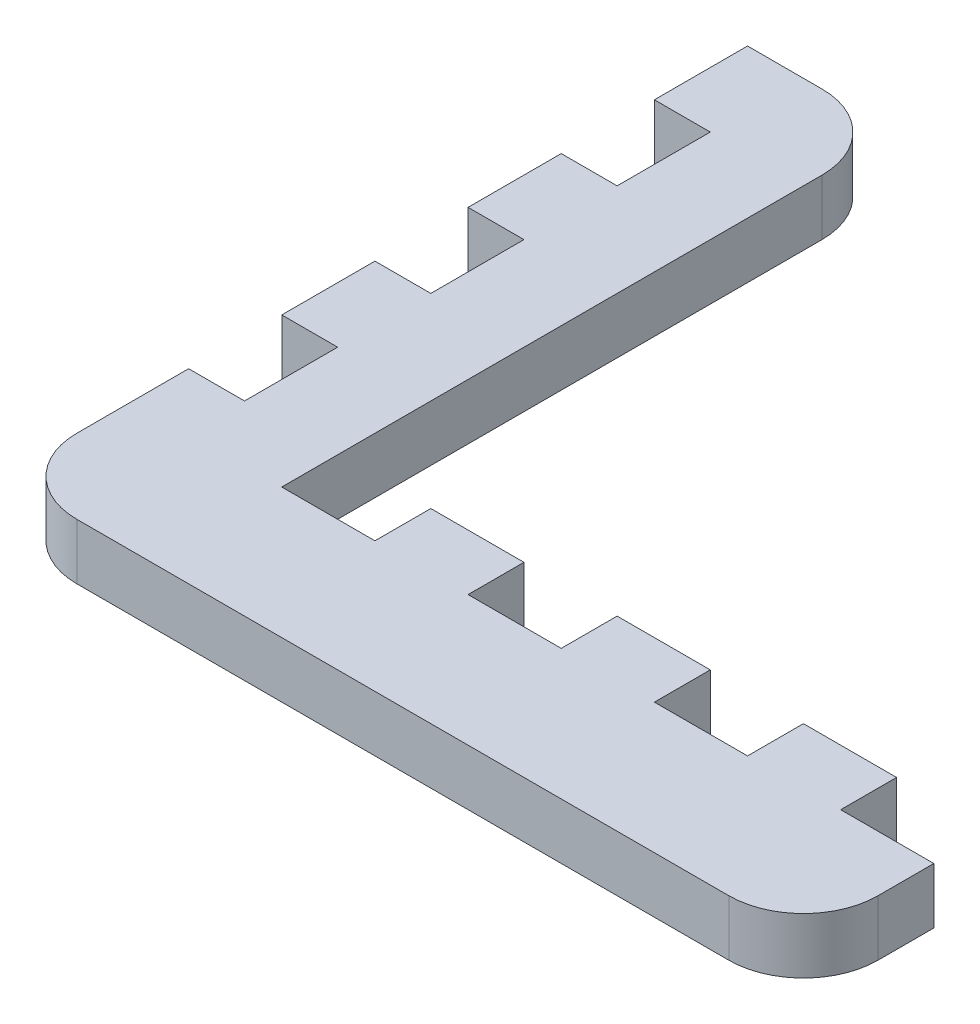
ISO-10303-21;
HEADER;
FILE_DESCRIPTION(('STEP AP214'),'2;1');
FILE_NAME('part.step','',(''),(''),'','','');
FILE_SCHEMA(('AUTOMOTIVE_DESIGN { 1 0 10303 214 1 1 1 1 }'));
ENDSEC;
DATA;
#1=APPLICATION_CONTEXT('core data for automotive mechanical design processes');
#2=APPLICATION_PROTOCOL_DEFINITION('international standard','automotive_design',2000,#1);
#3=PRODUCT_CONTEXT('',#1,'mechanical');
#4=PRODUCT('Part','Part','',(#3));
#5=PRODUCT_RELATED_PRODUCT_CATEGORY('part','',(#4));
#6=PRODUCT_DEFINITION_FORMATION('','',#4);
#7=PRODUCT_DEFINITION_CONTEXT('part definition',#1,'design');
#8=PRODUCT_DEFINITION('design','',#6,#7);
#9=PRODUCT_DEFINITION_SHAPE('','',#8);
#10=(LENGTH_UNIT() NAMED_UNIT(*) SI_UNIT(.MILLI.,.METRE.));
#11=(NAMED_UNIT(*) PLANE_ANGLE_UNIT() SI_UNIT($,.RADIAN.));
#12=(NAMED_UNIT(*) SI_UNIT($,.STERADIAN.) SOLID_ANGLE_UNIT());
#13=UNCERTAINTY_MEASURE_WITH_UNIT(LENGTH_MEASURE(1.E-05),#10,'distance_accuracy_value','');
#14=(GEOMETRIC_REPRESENTATION_CONTEXT(3) GLOBAL_UNCERTAINTY_ASSIGNED_CONTEXT((#13)) GLOBAL_UNIT_ASSIGNED_CONTEXT((#10,
#11,#12)) REPRESENTATION_CONTEXT('',''));
#15=CARTESIAN_POINT('',(0.,0.,0.));
#16=DIRECTION('',(0.,0.,1.));
#17=DIRECTION('',(1.,0.,0.));
#18=AXIS2_PLACEMENT_3D('',#15,#16,#17);
#19=CARTESIAN_POINT('',(-12.,44.4849370253831,-20.));
#20=DIRECTION('',(1.,0.,0.));
#21=DIRECTION('',(0.,0.,-1.));
#22=AXIS2_PLACEMENT_3D('',#19,#20,#21);
#23=PLANE('',#22);
#24=DIRECTION('',(0.,0.,1.));
#25=VECTOR('',#24,1.);
#26=CARTESIAN_POINT('',(-12.,0.,-20.));
#27=LINE('',#26,#25);
#28=CARTESIAN_POINT('',(-12.,0.,5.));
#29=VERTEX_POINT('',#28);
#30=CARTESIAN_POINT('',(-12.,0.,9.99999999999999));
#31=VERTEX_POINT('',#30);
#32=EDGE_CURVE('E399',#29,#31,#27,.T.);
#33=ORIENTED_EDGE('',*,*,#32,.T.);
#34=DIRECTION('',(0.,1.,0.));
#35=VECTOR('',#34,1.);
#36=CARTESIAN_POINT('',(-12.,0.,10.));
#37=LINE('',#36,#35);
#38=CARTESIAN_POINT('',(-12.,3.,9.99999999999999));
#39=VERTEX_POINT('',#38);
#40=EDGE_CURVE('E277',#31,#39,#37,.T.);
#41=ORIENTED_EDGE('',*,*,#40,.T.);
#42=DIRECTION('',(0.,0.,1.));
#43=VECTOR('',#42,1.);
#44=CARTESIAN_POINT('',(-12.,3.,-20.));
#45=LINE('',#44,#43);
#46=CARTESIAN_POINT('',(-12.,3.,5.));
#47=VERTEX_POINT('',#46);
#48=EDGE_CURVE('E403',#47,#39,#45,.T.);
#49=ORIENTED_EDGE('',*,*,#48,.F.);
#50=DIRECTION('',(0.,1.,0.));
#51=VECTOR('',#50,1.);
#52=CARTESIAN_POINT('',(-12.,0.,5.));
#53=LINE('',#52,#51);
#54=EDGE_CURVE('E312',#29,#47,#53,.T.);
#55=ORIENTED_EDGE('',*,*,#54,.F.);
#56=EDGE_LOOP('',(#33,#41,#49,#55));
#57=FACE_BOUND('',#56,.T.);
#58=ADVANCED_FACE('F40',(#57),#23,.F.);
#59=DIRECTION('',(0.,-1.,0.));
#60=VECTOR('',#59,1.);
#61=CARTESIAN_POINT('',(-12.,0.,0.));
#62=LINE('',#61,#60);
#63=CARTESIAN_POINT('',(-12.,3.,0.));
#64=VERTEX_POINT('',#63);
#65=CARTESIAN_POINT('',(-12.,0.,0.));
#66=VERTEX_POINT('',#65);
#67=EDGE_CURVE('E308',#64,#66,#62,.T.);
#68=ORIENTED_EDGE('',*,*,#67,.F.);
#69=CARTESIAN_POINT('',(-12.,3.,-5.));
#70=VERTEX_POINT('',#69);
#71=EDGE_CURVE('E410',#70,#64,#45,.T.);
#72=ORIENTED_EDGE('',*,*,#71,.F.);
#73=DIRECTION('',(0.,1.,0.));
#74=VECTOR('',#73,1.);
#75=CARTESIAN_POINT('',(-12.,0.,-5.));
#76=LINE('',#75,#74);
#77=CARTESIAN_POINT('',(-12.,0.,-5.));
#78=VERTEX_POINT('',#77);
#79=EDGE_CURVE('E349',#78,#70,#76,.T.);
#80=ORIENTED_EDGE('',*,*,#79,.F.);
#81=EDGE_CURVE('E404',#78,#66,#27,.T.);
#82=ORIENTED_EDGE('',*,*,#81,.T.);
#83=EDGE_LOOP('',(#68,#72,#80,#82));
#84=FACE_BOUND('',#83,.T.);
#85=ADVANCED_FACE('F626',(#84),#23,.F.);
#86=DIRECTION('',(0.,-1.,0.));
#87=VECTOR('',#86,1.);
#88=CARTESIAN_POINT('',(-12.,0.,-10.));
#89=LINE('',#88,#87);
#90=CARTESIAN_POINT('',(-12.,3.,-10.));
#91=VERTEX_POINT('',#90);
#92=CARTESIAN_POINT('',(-12.,0.,-10.));
#93=VERTEX_POINT('',#92);
#94=EDGE_CURVE('E345',#91,#93,#89,.T.);
#95=ORIENTED_EDGE('',*,*,#94,.F.);
#96=CARTESIAN_POINT('',(-12.,3.,-15.));
#97=VERTEX_POINT('',#96);
#98=EDGE_CURVE('E405',#97,#91,#45,.T.);
#99=ORIENTED_EDGE('',*,*,#98,.F.);
#100=DIRECTION('',(0.,1.,0.));
#101=VECTOR('',#100,1.);
#102=CARTESIAN_POINT('',(-12.,0.,-15.));
#103=LINE('',#102,#101);
#104=CARTESIAN_POINT('',(-12.,0.,-15.));
#105=VERTEX_POINT('',#104);
#106=EDGE_CURVE('E354',#105,#97,#103,.T.);
#107=ORIENTED_EDGE('',*,*,#106,.F.);
#108=EDGE_CURVE('E400',#105,#93,#27,.T.);
#109=ORIENTED_EDGE('',*,*,#108,.T.);
#110=EDGE_LOOP('',(#95,#99,#107,#109));
#111=FACE_BOUND('',#110,.T.);
#112=ADVANCED_FACE('F643',(#111),#23,.F.);
#113=CARTESIAN_POINT('',(23.,3.,-20.));
#114=DIRECTION('',(-1.,0.,0.));
#115=DIRECTION('',(0.,0.,1.));
#116=AXIS2_PLACEMENT_3D('',#113,#114,#115);
#117=PLANE('',#116);
#118=DIRECTION('',(0.,1.,0.));
#119=VECTOR('',#118,1.);
#120=CARTESIAN_POINT('',(23.,3.,13.));
#121=LINE('',#120,#119);
#122=CARTESIAN_POINT('',(23.,0.,13.));
#123=VERTEX_POINT('',#122);
#124=CARTESIAN_POINT('',(23.,3.,13.));
#125=VERTEX_POINT('',#124);
#126=EDGE_CURVE('E409',#123,#125,#121,.T.);
#127=ORIENTED_EDGE('',*,*,#126,.F.);
#128=DIRECTION('',(0.,0.,-1.));
#129=VECTOR('',#128,1.);
#130=CARTESIAN_POINT('',(23.,0.,-20.));
#131=LINE('',#130,#129);
#132=CARTESIAN_POINT('',(23.,0.,9.99999999999999));
#133=VERTEX_POINT('',#132);
#134=EDGE_CURVE('E539',#123,#133,#131,.T.);
#135=ORIENTED_EDGE('',*,*,#134,.T.);
#136=DIRECTION('',(0.,1.,0.));
#137=VECTOR('',#136,1.);
#138=CARTESIAN_POINT('',(23.,-46.0977222864644,9.99999999999999));
#139=LINE('',#138,#137);
#140=CARTESIAN_POINT('',(23.,3.,9.99999999999999));
#141=VERTEX_POINT('',#140);
#142=EDGE_CURVE('E547',#133,#141,#139,.T.);
#143=ORIENTED_EDGE('',*,*,#142,.T.);
#144=DIRECTION('',(0.,0.,-1.));
#145=VECTOR('',#144,1.);
#146=CARTESIAN_POINT('',(23.,3.,-20.));
#147=LINE('',#146,#145);
#148=EDGE_CURVE('E551',#125,#141,#147,.T.);
#149=ORIENTED_EDGE('',*,*,#148,.F.);
#150=EDGE_LOOP('',(#127,#135,#143,#149));
#151=FACE_BOUND('',#150,.T.);
#152=ADVANCED_FACE('F712',(#151),#117,.F.);
#153=CARTESIAN_POINT('',(23.,-46.0977222864644,9.99999999999999));
#154=DIRECTION('',(0.,0.,1.));
#155=DIRECTION('',(1.,0.,0.));
#156=AXIS2_PLACEMENT_3D('',#153,#154,#155);
#157=PLANE('',#156);
#158=DIRECTION('',(-1.,0.,0.));
#159=VECTOR('',#158,1.);
#160=CARTESIAN_POINT('',(23.,0.,9.99999999999999));
#161=LINE('',#160,#159);
#162=CARTESIAN_POINT('',(18.,0.,9.99999999999999));
#163=VERTEX_POINT('',#162);
#164=EDGE_CURVE('E535',#133,#163,#161,.T.);
#165=ORIENTED_EDGE('',*,*,#164,.T.);
#166=DIRECTION('',(0.,-1.,0.));
#167=VECTOR('',#166,1.);
#168=CARTESIAN_POINT('',(18.,0.,9.99999999999999));
#169=LINE('',#168,#167);
#170=CARTESIAN_POINT('',(18.,3.,9.99999999999999));
#171=VERTEX_POINT('',#170);
#172=EDGE_CURVE('E437',#171,#163,#169,.T.);
#173=ORIENTED_EDGE('',*,*,#172,.F.);
#174=DIRECTION('',(1.,0.,0.));
#175=VECTOR('',#174,1.);
#176=CARTESIAN_POINT('',(23.,3.,9.99999999999999));
#177=LINE('',#176,#175);
#178=EDGE_CURVE('E459',#171,#141,#177,.T.);
#179=ORIENTED_EDGE('',*,*,#178,.T.);
#180=ORIENTED_EDGE('',*,*,#142,.F.);
#181=EDGE_LOOP('',(#165,#173,#179,#180));
#182=FACE_BOUND('',#181,.T.);
#183=ADVANCED_FACE('F710',(#182),#157,.F.);
#184=CARTESIAN_POINT('',(8.,3.,10.));
#185=VERTEX_POINT('',#184);
#186=CARTESIAN_POINT('',(13.,3.,10.));
#187=VERTEX_POINT('',#186);
#188=EDGE_CURVE('E545',#185,#187,#177,.T.);
#189=ORIENTED_EDGE('',*,*,#188,.T.);
#190=DIRECTION('',(0.,1.,0.));
#191=VECTOR('',#190,1.);
#192=CARTESIAN_POINT('',(13.,0.,10.));
#193=LINE('',#192,#191);
#194=CARTESIAN_POINT('',(13.,0.,9.99999999999999));
#195=VERTEX_POINT('',#194);
#196=EDGE_CURVE('E449',#195,#187,#193,.T.);
#197=ORIENTED_EDGE('',*,*,#196,.F.);
#198=CARTESIAN_POINT('',(8.,0.,10.));
#199=VERTEX_POINT('',#198);
#200=EDGE_CURVE('E540',#195,#199,#161,.T.);
#201=ORIENTED_EDGE('',*,*,#200,.T.);
#202=DIRECTION('',(0.,-1.,0.));
#203=VECTOR('',#202,1.);
#204=CARTESIAN_POINT('',(8.,0.,10.));
#205=LINE('',#204,#203);
#206=EDGE_CURVE('E474',#185,#199,#205,.T.);
#207=ORIENTED_EDGE('',*,*,#206,.F.);
#208=EDGE_LOOP('',(#189,#197,#201,#207));
#209=FACE_BOUND('',#208,.T.);
#210=ADVANCED_FACE('F693',(#209),#157,.F.);
#211=CARTESIAN_POINT('',(-2.,3.,10.));
#212=VERTEX_POINT('',#211);
#213=CARTESIAN_POINT('',(3.,3.,10.));
#214=VERTEX_POINT('',#213);
#215=EDGE_CURVE('E546',#212,#214,#177,.T.);
#216=ORIENTED_EDGE('',*,*,#215,.T.);
#217=DIRECTION('',(0.,1.,0.));
#218=VECTOR('',#217,1.);
#219=CARTESIAN_POINT('',(3.,0.,10.));
#220=LINE('',#219,#218);
#221=CARTESIAN_POINT('',(3.,0.,10.));
#222=VERTEX_POINT('',#221);
#223=EDGE_CURVE('E486',#222,#214,#220,.T.);
#224=ORIENTED_EDGE('',*,*,#223,.F.);
#225=CARTESIAN_POINT('',(-2.,0.,10.));
#226=VERTEX_POINT('',#225);
#227=EDGE_CURVE('E541',#222,#226,#161,.T.);
#228=ORIENTED_EDGE('',*,*,#227,.T.);
#229=DIRECTION('',(0.,-1.,0.));
#230=VECTOR('',#229,1.);
#231=CARTESIAN_POINT('',(-2.,0.,10.));
#232=LINE('',#231,#230);
#233=EDGE_CURVE('E431',#212,#226,#232,.T.);
#234=ORIENTED_EDGE('',*,*,#233,.F.);
#235=EDGE_LOOP('',(#216,#224,#228,#234));
#236=FACE_BOUND('',#235,.T.);
#237=ADVANCED_FACE('F674',(#236),#157,.F.);
#238=CARTESIAN_POINT('',(-23.,3.,20.));
#239=DIRECTION('',(0.,0.,-1.));
#240=DIRECTION('',(-1.,0.,0.));
#241=AXIS2_PLACEMENT_3D('',#238,#239,#240);
#242=PLANE('',#241);
#243=DIRECTION('',(1.,0.,0.));
#244=VECTOR('',#243,1.);
#245=CARTESIAN_POINT('',(-23.,0.,20.));
#246=LINE('',#245,#244);
#247=CARTESIAN_POINT('',(-11.,0.,20.));
#248=VERTEX_POINT('',#247);
#249=CARTESIAN_POINT('',(24.,0.,20.));
#250=VERTEX_POINT('',#249);
#251=EDGE_CURVE('E555',#248,#250,#246,.T.);
#252=ORIENTED_EDGE('',*,*,#251,.T.);
#253=DIRECTION('',(0.,-1.,0.));
#254=VECTOR('',#253,1.);
#255=CARTESIAN_POINT('',(24.,3.,20.));
#256=LINE('',#255,#254);
#257=CARTESIAN_POINT('',(24.,3.,20.));
#258=VERTEX_POINT('',#257);
#259=EDGE_CURVE('E49',#250,#258,#256,.F.);
#260=ORIENTED_EDGE('',*,*,#259,.T.);
#261=DIRECTION('',(1.,0.,0.));
#262=VECTOR('',#261,1.);
#263=CARTESIAN_POINT('',(-23.,3.,20.));
#264=LINE('',#263,#262);
#265=CARTESIAN_POINT('',(-11.,3.,20.));
#266=VERTEX_POINT('',#265);
#267=EDGE_CURVE('E554',#266,#258,#264,.T.);
#268=ORIENTED_EDGE('',*,*,#267,.F.);
#269=DIRECTION('',(0.,1.,0.));
#270=VECTOR('',#269,1.);
#271=CARTESIAN_POINT('',(-11.,3.,20.));
#272=LINE('',#271,#270);
#273=EDGE_CURVE('E589',#266,#248,#272,.F.);
#274=ORIENTED_EDGE('',*,*,#273,.T.);
#275=EDGE_LOOP('',(#252,#260,#268,#274));
#276=FACE_BOUND('',#275,.T.);
#277=ADVANCED_FACE('F723',(#276),#242,.F.);
#278=CARTESIAN_POINT('',(0.,3.,0.));
#279=DIRECTION('',(0.,1.,0.));
#280=DIRECTION('',(0.,0.,1.));
#281=AXIS2_PLACEMENT_3D('',#278,#279,#280);
#282=PLANE('',#281);
#283=DIRECTION('',(0.,0.,-1.));
#284=VECTOR('',#283,1.);
#285=CARTESIAN_POINT('',(-7.00000000000001,3.,13.));
#286=LINE('',#285,#284);
#287=CARTESIAN_POINT('',(-7.00000000000001,3.,13.));
#288=VERTEX_POINT('',#287);
#289=CARTESIAN_POINT('',(-7.00000000000001,3.,-16.));
#290=VERTEX_POINT('',#289);
#291=EDGE_CURVE('E528',#288,#290,#286,.T.);
#292=ORIENTED_EDGE('',*,*,#291,.T.);
#293=CARTESIAN_POINT('',(-11.,3.,-16.));
#294=DIRECTION('',(0.,1.,0.));
#295=DIRECTION('',(0.,0.,1.));
#296=AXIS2_PLACEMENT_3D('',#293,#294,#295);
#297=CIRCLE('',#296,4.);
#298=CARTESIAN_POINT('',(-11.,3.,-20.));
#299=VERTEX_POINT('',#298);
#300=EDGE_CURVE('E582',#290,#299,#297,.T.);
#301=ORIENTED_EDGE('',*,*,#300,.T.);
#302=DIRECTION('',(1.,0.,0.));
#303=VECTOR('',#302,1.);
#304=CARTESIAN_POINT('',(-7.00000000000001,3.,-20.));
#305=LINE('',#304,#303);
#306=CARTESIAN_POINT('',(-15.,3.,-20.));
#307=VERTEX_POINT('',#306);
#308=EDGE_CURVE('E395',#307,#299,#305,.T.);
#309=ORIENTED_EDGE('',*,*,#308,.F.);
#310=DIRECTION('',(0.,0.,-1.));
#311=VECTOR('',#310,1.);
#312=CARTESIAN_POINT('',(-15.,3.,0.));
#313=LINE('',#312,#311);
#314=CARTESIAN_POINT('',(-15.,3.,-15.));
#315=VERTEX_POINT('',#314);
#316=EDGE_CURVE('E373',#315,#307,#313,.T.);
#317=ORIENTED_EDGE('',*,*,#316,.F.);
#318=DIRECTION('',(1.,0.,0.));
#319=VECTOR('',#318,1.);
#320=CARTESIAN_POINT('',(-15.,3.,-15.));
#321=LINE('',#320,#319);
#322=EDGE_CURVE('E381',#315,#97,#321,.T.);
#323=ORIENTED_EDGE('',*,*,#322,.T.);
#324=ORIENTED_EDGE('',*,*,#98,.T.);
#325=DIRECTION('',(1.,0.,0.));
#326=VECTOR('',#325,1.);
#327=CARTESIAN_POINT('',(-15.,3.,-10.));
#328=LINE('',#327,#326);
#329=CARTESIAN_POINT('',(-15.,3.,-10.));
#330=VERTEX_POINT('',#329);
#331=EDGE_CURVE('E336',#330,#91,#328,.T.);
#332=ORIENTED_EDGE('',*,*,#331,.F.);
#333=DIRECTION('',(0.,0.,-1.));
#334=VECTOR('',#333,1.);
#335=CARTESIAN_POINT('',(-15.,3.,0.));
#336=LINE('',#335,#334);
#337=CARTESIAN_POINT('',(-15.,3.,-5.));
#338=VERTEX_POINT('',#337);
#339=EDGE_CURVE('E357',#338,#330,#336,.T.);
#340=ORIENTED_EDGE('',*,*,#339,.F.);
#341=DIRECTION('',(1.,0.,0.));
#342=VECTOR('',#341,1.);
#343=CARTESIAN_POINT('',(-15.,3.,-5.));
#344=LINE('',#343,#342);
#345=EDGE_CURVE('E332',#338,#70,#344,.T.);
#346=ORIENTED_EDGE('',*,*,#345,.T.);
#347=ORIENTED_EDGE('',*,*,#71,.T.);
#348=DIRECTION('',(1.,0.,0.));
#349=VECTOR('',#348,1.);
#350=CARTESIAN_POINT('',(-15.,3.,0.));
#351=LINE('',#350,#349);
#352=CARTESIAN_POINT('',(-15.,3.,0.));
#353=VERTEX_POINT('',#352);
#354=EDGE_CURVE('E299',#353,#64,#351,.T.);
#355=ORIENTED_EDGE('',*,*,#354,.F.);
#356=DIRECTION('',(0.,0.,-1.));
#357=VECTOR('',#356,1.);
#358=CARTESIAN_POINT('',(-15.,3.,0.));
#359=LINE('',#358,#357);
#360=CARTESIAN_POINT('',(-15.,3.,5.));
#361=VERTEX_POINT('',#360);
#362=EDGE_CURVE('E320',#361,#353,#359,.T.);
#363=ORIENTED_EDGE('',*,*,#362,.F.);
#364=DIRECTION('',(1.,0.,0.));
#365=VECTOR('',#364,1.);
#366=CARTESIAN_POINT('',(-15.,3.,5.));
#367=LINE('',#366,#365);
#368=EDGE_CURVE('E295',#361,#47,#367,.T.);
#369=ORIENTED_EDGE('',*,*,#368,.T.);
#370=ORIENTED_EDGE('',*,*,#48,.T.);
#371=DIRECTION('',(1.,0.,0.));
#372=VECTOR('',#371,1.);
#373=CARTESIAN_POINT('',(-15.,3.,9.99999999999999));
#374=LINE('',#373,#372);
#375=CARTESIAN_POINT('',(-15.,3.,9.99999999999999));
#376=VERTEX_POINT('',#375);
#377=EDGE_CURVE('E279',#376,#39,#374,.T.);
#378=ORIENTED_EDGE('',*,*,#377,.F.);
#379=DIRECTION('',(0.,0.,-1.));
#380=VECTOR('',#379,1.);
#381=CARTESIAN_POINT('',(-15.,3.,20.));
#382=LINE('',#381,#380);
#383=CARTESIAN_POINT('',(-15.,3.,16.));
#384=VERTEX_POINT('',#383);
#385=EDGE_CURVE('E283',#384,#376,#382,.T.);
#386=ORIENTED_EDGE('',*,*,#385,.F.);
#387=CARTESIAN_POINT('',(-11.,3.,16.));
#388=DIRECTION('',(0.,1.,0.));
#389=DIRECTION('',(0.,0.,1.));
#390=AXIS2_PLACEMENT_3D('',#387,#388,#389);
#391=CIRCLE('',#390,4.);
#392=EDGE_CURVE('E577',#384,#266,#391,.T.);
#393=ORIENTED_EDGE('',*,*,#392,.T.);
#394=ORIENTED_EDGE('',*,*,#267,.T.);
#395=CARTESIAN_POINT('',(24.,3.,16.));
#396=DIRECTION('',(0.,1.,0.));
#397=DIRECTION('',(0.,0.,1.));
#398=AXIS2_PLACEMENT_3D('',#395,#396,#397);
#399=CIRCLE('',#398,4.);
#400=CARTESIAN_POINT('',(28.,3.,16.));
#401=VERTEX_POINT('',#400);
#402=EDGE_CURVE('E56',#258,#401,#399,.T.);
#403=ORIENTED_EDGE('',*,*,#402,.T.);
#404=DIRECTION('',(0.,0.,1.));
#405=VECTOR('',#404,1.);
#406=CARTESIAN_POINT('',(28.,3.,20.));
#407=LINE('',#406,#405);
#408=CARTESIAN_POINT('',(28.,3.,13.));
#409=VERTEX_POINT('',#408);
#410=EDGE_CURVE('E417',#409,#401,#407,.T.);
#411=ORIENTED_EDGE('',*,*,#410,.F.);
#412=DIRECTION('',(-1.,0.,0.));
#413=VECTOR('',#412,1.);
#414=CARTESIAN_POINT('',(28.,3.,13.));
#415=LINE('',#414,#413);
#416=EDGE_CURVE('E420',#409,#125,#415,.T.);
#417=ORIENTED_EDGE('',*,*,#416,.T.);
#418=ORIENTED_EDGE('',*,*,#148,.T.);
#419=ORIENTED_EDGE('',*,*,#178,.F.);
#420=DIRECTION('',(0.,0.,-1.));
#421=VECTOR('',#420,1.);
#422=CARTESIAN_POINT('',(18.,3.,13.));
#423=LINE('',#422,#421);
#424=CARTESIAN_POINT('',(18.,3.,13.));
#425=VERTEX_POINT('',#424);
#426=EDGE_CURVE('E460',#425,#171,#423,.T.);
#427=ORIENTED_EDGE('',*,*,#426,.F.);
#428=DIRECTION('',(1.,0.,0.));
#429=VECTOR('',#428,1.);
#430=CARTESIAN_POINT('',(0.,3.,13.));
#431=LINE('',#430,#429);
#432=CARTESIAN_POINT('',(13.,3.,13.));
#433=VERTEX_POINT('',#432);
#434=EDGE_CURVE('E441',#433,#425,#431,.T.);
#435=ORIENTED_EDGE('',*,*,#434,.F.);
#436=DIRECTION('',(0.,0.,-1.));
#437=VECTOR('',#436,1.);
#438=CARTESIAN_POINT('',(13.,3.,13.));
#439=LINE('',#438,#437);
#440=EDGE_CURVE('E463',#433,#187,#439,.T.);
#441=ORIENTED_EDGE('',*,*,#440,.T.);
#442=ORIENTED_EDGE('',*,*,#188,.F.);
#443=DIRECTION('',(0.,0.,-1.));
#444=VECTOR('',#443,1.);
#445=CARTESIAN_POINT('',(8.,3.,13.));
#446=LINE('',#445,#444);
#447=CARTESIAN_POINT('',(8.,3.,13.));
#448=VERTEX_POINT('',#447);
#449=EDGE_CURVE('E495',#448,#185,#446,.T.);
#450=ORIENTED_EDGE('',*,*,#449,.F.);
#451=DIRECTION('',(1.,0.,0.));
#452=VECTOR('',#451,1.);
#453=CARTESIAN_POINT('',(0.,3.,13.));
#454=LINE('',#453,#452);
#455=CARTESIAN_POINT('',(3.,3.,13.));
#456=VERTEX_POINT('',#455);
#457=EDGE_CURVE('E478',#456,#448,#454,.T.);
#458=ORIENTED_EDGE('',*,*,#457,.F.);
#459=DIRECTION('',(0.,0.,-1.));
#460=VECTOR('',#459,1.);
#461=CARTESIAN_POINT('',(3.,3.,13.));
#462=LINE('',#461,#460);
#463=EDGE_CURVE('E498',#456,#214,#462,.T.);
#464=ORIENTED_EDGE('',*,*,#463,.T.);
#465=ORIENTED_EDGE('',*,*,#215,.F.);
#466=DIRECTION('',(0.,0.,-1.));
#467=VECTOR('',#466,1.);
#468=CARTESIAN_POINT('',(-2.,3.,13.));
#469=LINE('',#468,#467);
#470=CARTESIAN_POINT('',(-2.,3.,13.));
#471=VERTEX_POINT('',#470);
#472=EDGE_CURVE('E525',#471,#212,#469,.T.);
#473=ORIENTED_EDGE('',*,*,#472,.F.);
#474=DIRECTION('',(1.,0.,0.));
#475=VECTOR('',#474,1.);
#476=CARTESIAN_POINT('',(0.,3.,13.));
#477=LINE('',#476,#475);
#478=EDGE_CURVE('E512',#288,#471,#477,.T.);
#479=ORIENTED_EDGE('',*,*,#478,.F.);
#480=EDGE_LOOP('',(#292,#301,#309,#317,#323,#324,#332,#340,#346,#347,#355,#363,#369,#370,#378,
#386,#393,#394,#403,#411,#417,#418,#419,#427,#435,#441,#442,#450,#458,#464,#465,#473,#479));
#481=FACE_BOUND('',#480,.T.);
#482=ADVANCED_FACE('F610',(#481),#282,.T.);
#483=CARTESIAN_POINT('',(0.,0.,0.));
#484=DIRECTION('',(0.,1.,0.));
#485=DIRECTION('',(0.,0.,1.));
#486=AXIS2_PLACEMENT_3D('',#483,#484,#485);
#487=PLANE('',#486);
#488=DIRECTION('',(-1.,0.,0.));
#489=VECTOR('',#488,1.);
#490=CARTESIAN_POINT('',(-7.00000000000001,0.,-20.));
#491=LINE('',#490,#489);
#492=CARTESIAN_POINT('',(-11.,0.,-20.));
#493=VERTEX_POINT('',#492);
#494=CARTESIAN_POINT('',(-15.,0.,-20.));
#495=VERTEX_POINT('',#494);
#496=EDGE_CURVE('E392',#493,#495,#491,.T.);
#497=ORIENTED_EDGE('',*,*,#496,.F.);
#498=CARTESIAN_POINT('',(-11.,0.,-16.));
#499=DIRECTION('',(0.,1.,0.));
#500=DIRECTION('',(0.,0.,1.));
#501=AXIS2_PLACEMENT_3D('',#498,#499,#500);
#502=CIRCLE('',#501,4.);
#503=CARTESIAN_POINT('',(-7.00000000000001,0.,-16.));
#504=VERTEX_POINT('',#503);
#505=EDGE_CURVE('E571',#493,#504,#502,.F.);
#506=ORIENTED_EDGE('',*,*,#505,.T.);
#507=DIRECTION('',(0.,0.,-1.));
#508=VECTOR('',#507,1.);
#509=CARTESIAN_POINT('',(-7.00000000000001,0.,13.));
#510=LINE('',#509,#508);
#511=CARTESIAN_POINT('',(-7.00000000000001,0.,13.));
#512=VERTEX_POINT('',#511);
#513=EDGE_CURVE('E519',#512,#504,#510,.T.);
#514=ORIENTED_EDGE('',*,*,#513,.F.);
#515=DIRECTION('',(-1.,0.,0.));
#516=VECTOR('',#515,1.);
#517=CARTESIAN_POINT('',(0.,0.,13.));
#518=LINE('',#517,#516);
#519=CARTESIAN_POINT('',(-2.,0.,13.));
#520=VERTEX_POINT('',#519);
#521=EDGE_CURVE('E504',#520,#512,#518,.T.);
#522=ORIENTED_EDGE('',*,*,#521,.F.);
#523=DIRECTION('',(0.,0.,-1.));
#524=VECTOR('',#523,1.);
#525=CARTESIAN_POINT('',(-2.,0.,13.));
#526=LINE('',#525,#524);
#527=EDGE_CURVE('E489',#520,#226,#526,.T.);
#528=ORIENTED_EDGE('',*,*,#527,.T.);
#529=ORIENTED_EDGE('',*,*,#227,.F.);
#530=DIRECTION('',(0.,0.,-1.));
#531=VECTOR('',#530,1.);
#532=CARTESIAN_POINT('',(3.,0.,13.));
#533=LINE('',#532,#531);
#534=CARTESIAN_POINT('',(3.,0.,13.));
#535=VERTEX_POINT('',#534);
#536=EDGE_CURVE('E485',#535,#222,#533,.T.);
#537=ORIENTED_EDGE('',*,*,#536,.F.);
#538=DIRECTION('',(-1.,0.,0.));
#539=VECTOR('',#538,1.);
#540=CARTESIAN_POINT('',(0.,0.,13.));
#541=LINE('',#540,#539);
#542=CARTESIAN_POINT('',(8.,0.,13.));
#543=VERTEX_POINT('',#542);
#544=EDGE_CURVE('E469',#543,#535,#541,.T.);
#545=ORIENTED_EDGE('',*,*,#544,.F.);
#546=DIRECTION('',(0.,0.,-1.));
#547=VECTOR('',#546,1.);
#548=CARTESIAN_POINT('',(8.,0.,13.));
#549=LINE('',#548,#547);
#550=EDGE_CURVE('E452',#543,#199,#549,.T.);
#551=ORIENTED_EDGE('',*,*,#550,.T.);
#552=ORIENTED_EDGE('',*,*,#200,.F.);
#553=DIRECTION('',(0.,0.,-1.));
#554=VECTOR('',#553,1.);
#555=CARTESIAN_POINT('',(13.,0.,13.));
#556=LINE('',#555,#554);
#557=CARTESIAN_POINT('',(13.,0.,13.));
#558=VERTEX_POINT('',#557);
#559=EDGE_CURVE('E448',#558,#195,#556,.T.);
#560=ORIENTED_EDGE('',*,*,#559,.F.);
#561=DIRECTION('',(-1.,0.,0.));
#562=VECTOR('',#561,1.);
#563=CARTESIAN_POINT('',(0.,0.,13.));
#564=LINE('',#563,#562);
#565=CARTESIAN_POINT('',(18.,0.,13.));
#566=VERTEX_POINT('',#565);
#567=EDGE_CURVE('E432',#566,#558,#564,.T.);
#568=ORIENTED_EDGE('',*,*,#567,.F.);
#569=DIRECTION('',(0.,0.,-1.));
#570=VECTOR('',#569,1.);
#571=CARTESIAN_POINT('',(18.,0.,13.));
#572=LINE('',#571,#570);
#573=EDGE_CURVE('E455',#566,#163,#572,.T.);
#574=ORIENTED_EDGE('',*,*,#573,.T.);
#575=ORIENTED_EDGE('',*,*,#164,.F.);
#576=ORIENTED_EDGE('',*,*,#134,.F.);
#577=DIRECTION('',(-1.,0.,0.));
#578=VECTOR('',#577,1.);
#579=CARTESIAN_POINT('',(28.,0.,13.));
#580=LINE('',#579,#578);
#581=CARTESIAN_POINT('',(28.,0.,13.));
#582=VERTEX_POINT('',#581);
#583=EDGE_CURVE('E427',#582,#123,#580,.T.);
#584=ORIENTED_EDGE('',*,*,#583,.F.);
#585=DIRECTION('',(0.,0.,-1.));
#586=VECTOR('',#585,1.);
#587=CARTESIAN_POINT('',(28.,0.,20.));
#588=LINE('',#587,#586);
#589=CARTESIAN_POINT('',(28.,0.,16.));
#590=VERTEX_POINT('',#589);
#591=EDGE_CURVE('E411',#590,#582,#588,.T.);
#592=ORIENTED_EDGE('',*,*,#591,.F.);
#593=CARTESIAN_POINT('',(24.,0.,16.));
#594=DIRECTION('',(0.,1.,0.));
#595=DIRECTION('',(0.,0.,1.));
#596=AXIS2_PLACEMENT_3D('',#593,#594,#595);
#597=CIRCLE('',#596,4.);
#598=EDGE_CURVE('E568',#590,#250,#597,.F.);
#599=ORIENTED_EDGE('',*,*,#598,.T.);
#600=ORIENTED_EDGE('',*,*,#251,.F.);
#601=CARTESIAN_POINT('',(-11.,0.,16.));
#602=DIRECTION('',(0.,1.,0.));
#603=DIRECTION('',(0.,0.,1.));
#604=AXIS2_PLACEMENT_3D('',#601,#602,#603);
#605=CIRCLE('',#604,4.);
#606=CARTESIAN_POINT('',(-15.,0.,16.));
#607=VERTEX_POINT('',#606);
#608=EDGE_CURVE('E266',#248,#607,#605,.F.);
#609=ORIENTED_EDGE('',*,*,#608,.T.);
#610=DIRECTION('',(0.,0.,-1.));
#611=VECTOR('',#610,1.);
#612=CARTESIAN_POINT('',(-15.,0.,20.));
#613=LINE('',#612,#611);
#614=CARTESIAN_POINT('',(-15.,0.,10.));
#615=VERTEX_POINT('',#614);
#616=EDGE_CURVE('E258',#607,#615,#613,.T.);
#617=ORIENTED_EDGE('',*,*,#616,.T.);
#618=DIRECTION('',(1.,0.,0.));
#619=VECTOR('',#618,1.);
#620=CARTESIAN_POINT('',(-15.,0.,10.));
#621=LINE('',#620,#619);
#622=EDGE_CURVE('E262',#615,#31,#621,.T.);
#623=ORIENTED_EDGE('',*,*,#622,.T.);
#624=ORIENTED_EDGE('',*,*,#32,.F.);
#625=DIRECTION('',(1.,0.,0.));
#626=VECTOR('',#625,1.);
#627=CARTESIAN_POINT('',(-15.,0.,5.));
#628=LINE('',#627,#626);
#629=CARTESIAN_POINT('',(-15.,0.,5.));
#630=VERTEX_POINT('',#629);
#631=EDGE_CURVE('E291',#630,#29,#628,.T.);
#632=ORIENTED_EDGE('',*,*,#631,.F.);
#633=DIRECTION('',(0.,0.,1.));
#634=VECTOR('',#633,1.);
#635=CARTESIAN_POINT('',(-15.,0.,0.));
#636=LINE('',#635,#634);
#637=CARTESIAN_POINT('',(-15.,0.,0.));
#638=VERTEX_POINT('',#637);
#639=EDGE_CURVE('E313',#638,#630,#636,.T.);
#640=ORIENTED_EDGE('',*,*,#639,.F.);
#641=DIRECTION('',(1.,0.,0.));
#642=VECTOR('',#641,1.);
#643=CARTESIAN_POINT('',(-15.,0.,0.));
#644=LINE('',#643,#642);
#645=EDGE_CURVE('E303',#638,#66,#644,.T.);
#646=ORIENTED_EDGE('',*,*,#645,.T.);
#647=ORIENTED_EDGE('',*,*,#81,.F.);
#648=DIRECTION('',(1.,0.,0.));
#649=VECTOR('',#648,1.);
#650=CARTESIAN_POINT('',(-15.,0.,-5.));
#651=LINE('',#650,#649);
#652=CARTESIAN_POINT('',(-15.,0.,-5.));
#653=VERTEX_POINT('',#652);
#654=EDGE_CURVE('E317',#653,#78,#651,.T.);
#655=ORIENTED_EDGE('',*,*,#654,.F.);
#656=DIRECTION('',(0.,0.,1.));
#657=VECTOR('',#656,1.);
#658=CARTESIAN_POINT('',(-15.,0.,0.));
#659=LINE('',#658,#657);
#660=CARTESIAN_POINT('',(-15.,0.,-10.));
#661=VERTEX_POINT('',#660);
#662=EDGE_CURVE('E350',#661,#653,#659,.T.);
#663=ORIENTED_EDGE('',*,*,#662,.F.);
#664=DIRECTION('',(1.,0.,0.));
#665=VECTOR('',#664,1.);
#666=CARTESIAN_POINT('',(-15.,0.,-10.));
#667=LINE('',#666,#665);
#668=EDGE_CURVE('E340',#661,#93,#667,.T.);
#669=ORIENTED_EDGE('',*,*,#668,.T.);
#670=ORIENTED_EDGE('',*,*,#108,.F.);
#671=DIRECTION('',(1.,0.,0.));
#672=VECTOR('',#671,1.);
#673=CARTESIAN_POINT('',(-15.,0.,-15.));
#674=LINE('',#673,#672);
#675=CARTESIAN_POINT('',(-15.,0.,-15.));
#676=VERTEX_POINT('',#675);
#677=EDGE_CURVE('E388',#676,#105,#674,.T.);
#678=ORIENTED_EDGE('',*,*,#677,.F.);
#679=DIRECTION('',(0.,0.,1.));
#680=VECTOR('',#679,1.);
#681=CARTESIAN_POINT('',(-15.,0.,0.));
#682=LINE('',#681,#680);
#683=EDGE_CURVE('E366',#495,#676,#682,.T.);
#684=ORIENTED_EDGE('',*,*,#683,.F.);
#685=EDGE_LOOP('',(#497,#506,#514,#522,#528,#529,#537,#545,#551,#552,#560,#568,#574,#575,#576,
#584,#592,#599,#600,#609,#617,#623,#624,#632,#640,#646,#647,#655,#663,#669,#670,#678,#684));
#686=FACE_BOUND('',#685,.T.);
#687=ADVANCED_FACE('F261',(#686),#487,.F.);
#688=CARTESIAN_POINT('',(-2.,0.,13.));
#689=DIRECTION('',(1.,0.,0.));
#690=DIRECTION('',(0.,0.,-1.));
#691=AXIS2_PLACEMENT_3D('',#688,#689,#690);
#692=PLANE('',#691);
#693=ORIENTED_EDGE('',*,*,#233,.T.);
#694=ORIENTED_EDGE('',*,*,#527,.F.);
#695=DIRECTION('',(0.,-1.,0.));
#696=VECTOR('',#695,1.);
#697=CARTESIAN_POINT('',(-2.,0.,13.));
#698=LINE('',#697,#696);
#699=EDGE_CURVE('E515',#471,#520,#698,.T.);
#700=ORIENTED_EDGE('',*,*,#699,.F.);
#701=ORIENTED_EDGE('',*,*,#472,.T.);
#702=EDGE_LOOP('',(#693,#694,#700,#701));
#703=FACE_BOUND('',#702,.T.);
#704=ADVANCED_FACE('F756',(#703),#692,.F.);
#705=CARTESIAN_POINT('',(-7.00000000000001,0.,13.));
#706=DIRECTION('',(-1.,0.,0.));
#707=DIRECTION('',(0.,0.,1.));
#708=AXIS2_PLACEMENT_3D('',#705,#706,#707);
#709=PLANE('',#708);
#710=ORIENTED_EDGE('',*,*,#513,.T.);
#711=DIRECTION('',(0.,-1.,0.));
#712=VECTOR('',#711,1.);
#713=CARTESIAN_POINT('',(-7.00000000000001,3.,-16.));
#714=LINE('',#713,#712);
#715=EDGE_CURVE('E574',#504,#290,#714,.F.);
#716=ORIENTED_EDGE('',*,*,#715,.T.);
#717=ORIENTED_EDGE('',*,*,#291,.F.);
#718=DIRECTION('',(0.,1.,0.));
#719=VECTOR('',#718,1.);
#720=CARTESIAN_POINT('',(-7.00000000000001,0.,13.));
#721=LINE('',#720,#719);
#722=EDGE_CURVE('E508',#512,#288,#721,.T.);
#723=ORIENTED_EDGE('',*,*,#722,.F.);
#724=EDGE_LOOP('',(#710,#716,#717,#723));
#725=FACE_BOUND('',#724,.T.);
#726=ADVANCED_FACE('F663',(#725),#709,.F.);
#727=CARTESIAN_POINT('',(0.,0.,13.));
#728=DIRECTION('',(0.,0.,-1.));
#729=DIRECTION('',(-1.,0.,0.));
#730=AXIS2_PLACEMENT_3D('',#727,#728,#729);
#731=PLANE('',#730);
#732=ORIENTED_EDGE('',*,*,#521,.T.);
#733=ORIENTED_EDGE('',*,*,#722,.T.);
#734=ORIENTED_EDGE('',*,*,#478,.T.);
#735=ORIENTED_EDGE('',*,*,#699,.T.);
#736=EDGE_LOOP('',(#732,#733,#734,#735));
#737=FACE_BOUND('',#736,.T.);
#738=ADVANCED_FACE('F666',(#737),#731,.T.);
#739=CARTESIAN_POINT('',(8.,0.,13.));
#740=DIRECTION('',(1.,0.,0.));
#741=DIRECTION('',(0.,0.,-1.));
#742=AXIS2_PLACEMENT_3D('',#739,#740,#741);
#743=PLANE('',#742);
#744=ORIENTED_EDGE('',*,*,#206,.T.);
#745=ORIENTED_EDGE('',*,*,#550,.F.);
#746=DIRECTION('',(0.,-1.,0.));
#747=VECTOR('',#746,1.);
#748=CARTESIAN_POINT('',(8.,0.,13.));
#749=LINE('',#748,#747);
#750=EDGE_CURVE('E481',#448,#543,#749,.T.);
#751=ORIENTED_EDGE('',*,*,#750,.F.);
#752=ORIENTED_EDGE('',*,*,#449,.T.);
#753=EDGE_LOOP('',(#744,#745,#751,#752));
#754=FACE_BOUND('',#753,.T.);
#755=ADVANCED_FACE('F687',(#754),#743,.F.);
#756=CARTESIAN_POINT('',(3.,0.,13.));
#757=DIRECTION('',(-1.,0.,0.));
#758=DIRECTION('',(0.,-1.,0.));
#759=AXIS2_PLACEMENT_3D('',#756,#757,#758);
#760=PLANE('',#759);
#761=ORIENTED_EDGE('',*,*,#223,.T.);
#762=ORIENTED_EDGE('',*,*,#463,.F.);
#763=DIRECTION('',(0.,1.,0.));
#764=VECTOR('',#763,1.);
#765=CARTESIAN_POINT('',(3.,0.,13.));
#766=LINE('',#765,#764);
#767=EDGE_CURVE('E473',#535,#456,#766,.T.);
#768=ORIENTED_EDGE('',*,*,#767,.F.);
#769=ORIENTED_EDGE('',*,*,#536,.T.);
#770=EDGE_LOOP('',(#761,#762,#768,#769));
#771=FACE_BOUND('',#770,.T.);
#772=ADVANCED_FACE('F677',(#771),#760,.F.);
#773=CARTESIAN_POINT('',(0.,0.,13.));
#774=DIRECTION('',(0.,0.,-1.));
#775=DIRECTION('',(-1.,0.,0.));
#776=AXIS2_PLACEMENT_3D('',#773,#774,#775);
#777=PLANE('',#776);
#778=ORIENTED_EDGE('',*,*,#544,.T.);
#779=ORIENTED_EDGE('',*,*,#767,.T.);
#780=ORIENTED_EDGE('',*,*,#457,.T.);
#781=ORIENTED_EDGE('',*,*,#750,.T.);
#782=EDGE_LOOP('',(#778,#779,#780,#781));
#783=FACE_BOUND('',#782,.T.);
#784=ADVANCED_FACE('F684',(#783),#777,.T.);
#785=CARTESIAN_POINT('',(18.,0.,13.));
#786=DIRECTION('',(1.,0.,0.));
#787=DIRECTION('',(0.,0.,-1.));
#788=AXIS2_PLACEMENT_3D('',#785,#786,#787);
#789=PLANE('',#788);
#790=ORIENTED_EDGE('',*,*,#172,.T.);
#791=ORIENTED_EDGE('',*,*,#573,.F.);
#792=DIRECTION('',(0.,-1.,0.));
#793=VECTOR('',#792,1.);
#794=CARTESIAN_POINT('',(18.,0.,13.));
#795=LINE('',#794,#793);
#796=EDGE_CURVE('E444',#425,#566,#795,.T.);
#797=ORIENTED_EDGE('',*,*,#796,.F.);
#798=ORIENTED_EDGE('',*,*,#426,.T.);
#799=EDGE_LOOP('',(#790,#791,#797,#798));
#800=FACE_BOUND('',#799,.T.);
#801=ADVANCED_FACE('F704',(#800),#789,.F.);
#802=CARTESIAN_POINT('',(13.,0.,13.));
#803=DIRECTION('',(-1.,0.,0.));
#804=DIRECTION('',(0.,0.,1.));
#805=AXIS2_PLACEMENT_3D('',#802,#803,#804);
#806=PLANE('',#805);
#807=ORIENTED_EDGE('',*,*,#196,.T.);
#808=ORIENTED_EDGE('',*,*,#440,.F.);
#809=DIRECTION('',(0.,1.,0.));
#810=VECTOR('',#809,1.);
#811=CARTESIAN_POINT('',(13.,0.,13.));
#812=LINE('',#811,#810);
#813=EDGE_CURVE('E436',#558,#433,#812,.T.);
#814=ORIENTED_EDGE('',*,*,#813,.F.);
#815=ORIENTED_EDGE('',*,*,#559,.T.);
#816=EDGE_LOOP('',(#807,#808,#814,#815));
#817=FACE_BOUND('',#816,.T.);
#818=ADVANCED_FACE('F695',(#817),#806,.F.);
#819=CARTESIAN_POINT('',(0.,0.,13.));
#820=DIRECTION('',(0.,0.,-1.));
#821=DIRECTION('',(-1.,0.,0.));
#822=AXIS2_PLACEMENT_3D('',#819,#820,#821);
#823=PLANE('',#822);
#824=ORIENTED_EDGE('',*,*,#567,.T.);
#825=ORIENTED_EDGE('',*,*,#813,.T.);
#826=ORIENTED_EDGE('',*,*,#434,.T.);
#827=ORIENTED_EDGE('',*,*,#796,.T.);
#828=EDGE_LOOP('',(#824,#825,#826,#827));
#829=FACE_BOUND('',#828,.T.);
#830=ADVANCED_FACE('F701',(#829),#823,.T.);
#831=CARTESIAN_POINT('',(28.,3.,13.));
#832=DIRECTION('',(0.,0.,1.));
#833=DIRECTION('',(0.,-1.,0.));
#834=AXIS2_PLACEMENT_3D('',#831,#832,#833);
#835=PLANE('',#834);
#836=ORIENTED_EDGE('',*,*,#126,.T.);
#837=ORIENTED_EDGE('',*,*,#416,.F.);
#838=DIRECTION('',(0.,1.,0.));
#839=VECTOR('',#838,1.);
#840=CARTESIAN_POINT('',(28.,3.,13.));
#841=LINE('',#840,#839);
#842=EDGE_CURVE('E414',#582,#409,#841,.T.);
#843=ORIENTED_EDGE('',*,*,#842,.F.);
#844=ORIENTED_EDGE('',*,*,#583,.T.);
#845=EDGE_LOOP('',(#836,#837,#843,#844));
#846=FACE_BOUND('',#845,.T.);
#847=ADVANCED_FACE('F717',(#846),#835,.F.);
#848=CARTESIAN_POINT('',(28.,0.,0.));
#849=DIRECTION('',(1.,0.,0.));
#850=DIRECTION('',(0.,0.,-1.));
#851=AXIS2_PLACEMENT_3D('',#848,#849,#850);
#852=PLANE('',#851);
#853=ORIENTED_EDGE('',*,*,#410,.T.);
#854=DIRECTION('',(0.,-1.,0.));
#855=VECTOR('',#854,1.);
#856=CARTESIAN_POINT('',(28.,0.,16.));
#857=LINE('',#856,#855);
#858=EDGE_CURVE('E585',#401,#590,#857,.T.);
#859=ORIENTED_EDGE('',*,*,#858,.T.);
#860=ORIENTED_EDGE('',*,*,#591,.T.);
#861=ORIENTED_EDGE('',*,*,#842,.T.);
#862=EDGE_LOOP('',(#853,#859,#860,#861));
#863=FACE_BOUND('',#862,.T.);
#864=ADVANCED_FACE('F720',(#863),#852,.T.);
#865=CARTESIAN_POINT('',(0.,0.,-20.));
#866=DIRECTION('',(0.,0.,-1.));
#867=DIRECTION('',(-1.,0.,0.));
#868=AXIS2_PLACEMENT_3D('',#865,#866,#867);
#869=PLANE('',#868);
#870=ORIENTED_EDGE('',*,*,#308,.T.);
#871=DIRECTION('',(0.,-1.,0.));
#872=VECTOR('',#871,1.);
#873=CARTESIAN_POINT('',(-11.,0.,-20.));
#874=LINE('',#873,#872);
#875=EDGE_CURVE('E558',#299,#493,#874,.T.);
#876=ORIENTED_EDGE('',*,*,#875,.T.);
#877=ORIENTED_EDGE('',*,*,#496,.T.);
#878=DIRECTION('',(0.,-1.,0.));
#879=VECTOR('',#878,1.);
#880=CARTESIAN_POINT('',(-15.,0.,-20.));
#881=LINE('',#880,#879);
#882=EDGE_CURVE('E377',#307,#495,#881,.T.);
#883=ORIENTED_EDGE('',*,*,#882,.F.);
#884=EDGE_LOOP('',(#870,#876,#877,#883));
#885=FACE_BOUND('',#884,.T.);
#886=ADVANCED_FACE('F654',(#885),#869,.T.);
#887=CARTESIAN_POINT('',(-15.,0.,-15.));
#888=DIRECTION('',(0.,0.,-1.));
#889=DIRECTION('',(-1.,0.,0.));
#890=AXIS2_PLACEMENT_3D('',#887,#888,#889);
#891=PLANE('',#890);
#892=ORIENTED_EDGE('',*,*,#106,.T.);
#893=ORIENTED_EDGE('',*,*,#322,.F.);
#894=DIRECTION('',(0.,1.,0.));
#895=VECTOR('',#894,1.);
#896=CARTESIAN_POINT('',(-15.,0.,-15.));
#897=LINE('',#896,#895);
#898=EDGE_CURVE('E370',#676,#315,#897,.T.);
#899=ORIENTED_EDGE('',*,*,#898,.F.);
#900=ORIENTED_EDGE('',*,*,#677,.T.);
#901=EDGE_LOOP('',(#892,#893,#899,#900));
#902=FACE_BOUND('',#901,.T.);
#903=ADVANCED_FACE('F647',(#902),#891,.F.);
#904=CARTESIAN_POINT('',(-15.,0.,0.));
#905=DIRECTION('',(-1.,0.,0.));
#906=DIRECTION('',(0.,0.,1.));
#907=AXIS2_PLACEMENT_3D('',#904,#905,#906);
#908=PLANE('',#907);
#909=ORIENTED_EDGE('',*,*,#683,.T.);
#910=ORIENTED_EDGE('',*,*,#898,.T.);
#911=ORIENTED_EDGE('',*,*,#316,.T.);
#912=ORIENTED_EDGE('',*,*,#882,.T.);
#913=EDGE_LOOP('',(#909,#910,#911,#912));
#914=FACE_BOUND('',#913,.T.);
#915=ADVANCED_FACE('F651',(#914),#908,.T.);
#916=CARTESIAN_POINT('',(-15.,0.,-5.));
#917=DIRECTION('',(0.,0.,-1.));
#918=DIRECTION('',(-1.,0.,0.));
#919=AXIS2_PLACEMENT_3D('',#916,#917,#918);
#920=PLANE('',#919);
#921=ORIENTED_EDGE('',*,*,#79,.T.);
#922=ORIENTED_EDGE('',*,*,#345,.F.);
#923=DIRECTION('',(0.,1.,0.));
#924=VECTOR('',#923,1.);
#925=CARTESIAN_POINT('',(-15.,0.,-5.));
#926=LINE('',#925,#924);
#927=EDGE_CURVE('E360',#653,#338,#926,.T.);
#928=ORIENTED_EDGE('',*,*,#927,.F.);
#929=ORIENTED_EDGE('',*,*,#654,.T.);
#930=EDGE_LOOP('',(#921,#922,#928,#929));
#931=FACE_BOUND('',#930,.T.);
#932=ADVANCED_FACE('F632',(#931),#920,.F.);
#933=CARTESIAN_POINT('',(-15.,0.,-10.));
#934=DIRECTION('',(0.,0.,1.));
#935=DIRECTION('',(1.,0.,0.));
#936=AXIS2_PLACEMENT_3D('',#933,#934,#935);
#937=PLANE('',#936);
#938=ORIENTED_EDGE('',*,*,#94,.T.);
#939=ORIENTED_EDGE('',*,*,#668,.F.);
#940=DIRECTION('',(0.,-1.,0.));
#941=VECTOR('',#940,1.);
#942=CARTESIAN_POINT('',(-15.,0.,-10.));
#943=LINE('',#942,#941);
#944=EDGE_CURVE('E344',#330,#661,#943,.T.);
#945=ORIENTED_EDGE('',*,*,#944,.F.);
#946=ORIENTED_EDGE('',*,*,#331,.T.);
#947=EDGE_LOOP('',(#938,#939,#945,#946));
#948=FACE_BOUND('',#947,.T.);
#949=ADVANCED_FACE('F641',(#948),#937,.F.);
#950=CARTESIAN_POINT('',(-15.,0.,0.));
#951=DIRECTION('',(-1.,0.,0.));
#952=DIRECTION('',(0.,0.,1.));
#953=AXIS2_PLACEMENT_3D('',#950,#951,#952);
#954=PLANE('',#953);
#955=ORIENTED_EDGE('',*,*,#662,.T.);
#956=ORIENTED_EDGE('',*,*,#927,.T.);
#957=ORIENTED_EDGE('',*,*,#339,.T.);
#958=ORIENTED_EDGE('',*,*,#944,.T.);
#959=EDGE_LOOP('',(#955,#956,#957,#958));
#960=FACE_BOUND('',#959,.T.);
#961=ADVANCED_FACE('F638',(#960),#954,.T.);
#962=CARTESIAN_POINT('',(-15.,0.,5.));
#963=DIRECTION('',(0.,0.,-1.));
#964=DIRECTION('',(-1.,0.,0.));
#965=AXIS2_PLACEMENT_3D('',#962,#963,#964);
#966=PLANE('',#965);
#967=ORIENTED_EDGE('',*,*,#54,.T.);
#968=ORIENTED_EDGE('',*,*,#368,.F.);
#969=DIRECTION('',(0.,1.,0.));
#970=VECTOR('',#969,1.);
#971=CARTESIAN_POINT('',(-15.,0.,5.));
#972=LINE('',#971,#970);
#973=EDGE_CURVE('E323',#630,#361,#972,.T.);
#974=ORIENTED_EDGE('',*,*,#973,.F.);
#975=ORIENTED_EDGE('',*,*,#631,.T.);
#976=EDGE_LOOP('',(#967,#968,#974,#975));
#977=FACE_BOUND('',#976,.T.);
#978=ADVANCED_FACE('F615',(#977),#966,.F.);
#979=CARTESIAN_POINT('',(-15.,0.,0.));
#980=DIRECTION('',(0.,0.,1.));
#981=DIRECTION('',(1.,0.,0.));
#982=AXIS2_PLACEMENT_3D('',#979,#980,#981);
#983=PLANE('',#982);
#984=ORIENTED_EDGE('',*,*,#67,.T.);
#985=ORIENTED_EDGE('',*,*,#645,.F.);
#986=DIRECTION('',(0.,-1.,0.));
#987=VECTOR('',#986,1.);
#988=CARTESIAN_POINT('',(-15.,0.,0.));
#989=LINE('',#988,#987);
#990=EDGE_CURVE('E307',#353,#638,#989,.T.);
#991=ORIENTED_EDGE('',*,*,#990,.F.);
#992=ORIENTED_EDGE('',*,*,#354,.T.);
#993=EDGE_LOOP('',(#984,#985,#991,#992));
#994=FACE_BOUND('',#993,.T.);
#995=ADVANCED_FACE('F624',(#994),#983,.F.);
#996=CARTESIAN_POINT('',(-15.,0.,0.));
#997=DIRECTION('',(-1.,0.,0.));
#998=DIRECTION('',(0.,0.,1.));
#999=AXIS2_PLACEMENT_3D('',#996,#997,#998);
#1000=PLANE('',#999);
#1001=ORIENTED_EDGE('',*,*,#639,.T.);
#1002=ORIENTED_EDGE('',*,*,#973,.T.);
#1003=ORIENTED_EDGE('',*,*,#362,.T.);
#1004=ORIENTED_EDGE('',*,*,#990,.T.);
#1005=EDGE_LOOP('',(#1001,#1002,#1003,#1004));
#1006=FACE_BOUND('',#1005,.T.);
#1007=ADVANCED_FACE('F620',(#1006),#1000,.T.);
#1008=CARTESIAN_POINT('',(-15.,0.,10.));
#1009=DIRECTION('',(0.,0.,-1.));
#1010=DIRECTION('',(0.,1.,0.));
#1011=AXIS2_PLACEMENT_3D('',#1008,#1009,#1010);
#1012=PLANE('',#1011);
#1013=ORIENTED_EDGE('',*,*,#40,.F.);
#1014=ORIENTED_EDGE('',*,*,#622,.F.);
#1015=DIRECTION('',(0.,1.,0.));
#1016=VECTOR('',#1015,1.);
#1017=CARTESIAN_POINT('',(-15.,0.,10.));
#1018=LINE('',#1017,#1016);
#1019=EDGE_CURVE('E271',#615,#376,#1018,.T.);
#1020=ORIENTED_EDGE('',*,*,#1019,.T.);
#1021=ORIENTED_EDGE('',*,*,#377,.T.);
#1022=EDGE_LOOP('',(#1013,#1014,#1020,#1021));
#1023=FACE_BOUND('',#1022,.T.);
#1024=ADVANCED_FACE('F275',(#1023),#1012,.T.);
#1025=CARTESIAN_POINT('',(-15.,0.,0.));
#1026=DIRECTION('',(1.,0.,0.));
#1027=DIRECTION('',(0.,0.,-1.));
#1028=AXIS2_PLACEMENT_3D('',#1025,#1026,#1027);
#1029=PLANE('',#1028);
#1030=ORIENTED_EDGE('',*,*,#616,.F.);
#1031=DIRECTION('',(0.,1.,0.));
#1032=VECTOR('',#1031,1.);
#1033=CARTESIAN_POINT('',(-15.,0.,16.));
#1034=LINE('',#1033,#1032);
#1035=EDGE_CURVE('E11',#607,#384,#1034,.T.);
#1036=ORIENTED_EDGE('',*,*,#1035,.T.);
#1037=ORIENTED_EDGE('',*,*,#385,.T.);
#1038=ORIENTED_EDGE('',*,*,#1019,.F.);
#1039=EDGE_LOOP('',(#1030,#1036,#1037,#1038));
#1040=FACE_BOUND('',#1039,.T.);
#1041=ADVANCED_FACE('F281',(#1040),#1029,.F.);
#1042=CARTESIAN_POINT('',(-11.,0.,-16.));
#1043=DIRECTION('',(0.,1.,0.));
#1044=DIRECTION('',(0.,0.,1.));
#1045=AXIS2_PLACEMENT_3D('',#1042,#1043,#1044);
#1046=CYLINDRICAL_SURFACE('',#1045,4.);
#1047=ORIENTED_EDGE('',*,*,#300,.F.);
#1048=ORIENTED_EDGE('',*,*,#715,.F.);
#1049=ORIENTED_EDGE('',*,*,#505,.F.);
#1050=ORIENTED_EDGE('',*,*,#875,.F.);
#1051=EDGE_LOOP('',(#1047,#1048,#1049,#1050));
#1052=FACE_BOUND('',#1051,.T.);
#1053=ADVANCED_FACE('F658',(#1052),#1046,.T.);
#1054=CARTESIAN_POINT('',(24.,0.,16.));
#1055=DIRECTION('',(0.,1.,0.));
#1056=DIRECTION('',(0.,0.,1.));
#1057=AXIS2_PLACEMENT_3D('',#1054,#1055,#1056);
#1058=CYLINDRICAL_SURFACE('',#1057,4.);
#1059=ORIENTED_EDGE('',*,*,#402,.F.);
#1060=ORIENTED_EDGE('',*,*,#259,.F.);
#1061=ORIENTED_EDGE('',*,*,#598,.F.);
#1062=ORIENTED_EDGE('',*,*,#858,.F.);
#1063=EDGE_LOOP('',(#1059,#1060,#1061,#1062));
#1064=FACE_BOUND('',#1063,.T.);
#1065=ADVANCED_FACE('F725',(#1064),#1058,.T.);
#1066=CARTESIAN_POINT('',(-11.,0.,16.));
#1067=DIRECTION('',(0.,1.,0.));
#1068=DIRECTION('',(0.,0.,1.));
#1069=AXIS2_PLACEMENT_3D('',#1066,#1067,#1068);
#1070=CYLINDRICAL_SURFACE('',#1069,4.);
#1071=ORIENTED_EDGE('',*,*,#608,.F.);
#1072=ORIENTED_EDGE('',*,*,#273,.F.);
#1073=ORIENTED_EDGE('',*,*,#392,.F.);
#1074=ORIENTED_EDGE('',*,*,#1035,.F.);
#1075=EDGE_LOOP('',(#1071,#1072,#1073,#1074));
#1076=FACE_BOUND('',#1075,.T.);
#1077=ADVANCED_FACE('F42',(#1076),#1070,.T.);
#1078=CLOSED_SHELL('',(#58,#85,#112,#152,#183,#210,#237,#277,#482,#687,#704,#726,#738,#755,#772,
#784,#801,#818,#830,#847,#864,#886,#903,#915,#932,#949,#961,#978,#995,#1007,#1024,#1041,#1053,
#1065,#1077));
#1079=MANIFOLD_SOLID_BREP('B2',#1078);
#1080=ADVANCED_BREP_SHAPE_REPRESENTATION('',(#18,#1079),#14);
#1081=SHAPE_DEFINITION_REPRESENTATION(#9,#1080);
ENDSEC;
END-ISO-10303-21;
